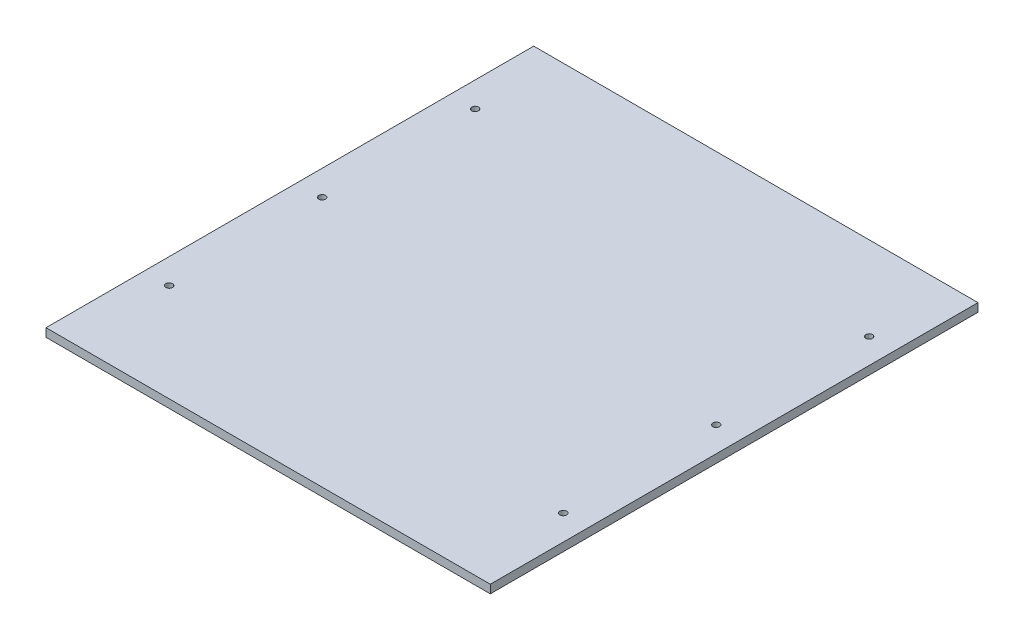
ISO-10303-21;
HEADER;
FILE_DESCRIPTION(('STEP AP214'),'2;1');
FILE_NAME('part.step','',(''),(''),'','','');
FILE_SCHEMA(('AUTOMOTIVE_DESIGN { 1 0 10303 214 1 1 1 1 }'));
ENDSEC;
DATA;
#1=APPLICATION_CONTEXT('core data for automotive mechanical design processes');
#2=APPLICATION_PROTOCOL_DEFINITION('international standard','automotive_design',2000,#1);
#3=PRODUCT_CONTEXT('',#1,'mechanical');
#4=PRODUCT('Part','Part','',(#3));
#5=PRODUCT_RELATED_PRODUCT_CATEGORY('part','',(#4));
#6=PRODUCT_DEFINITION_FORMATION('','',#4);
#7=PRODUCT_DEFINITION_CONTEXT('part definition',#1,'design');
#8=PRODUCT_DEFINITION('design','',#6,#7);
#9=PRODUCT_DEFINITION_SHAPE('','',#8);
#10=(LENGTH_UNIT() NAMED_UNIT(*) SI_UNIT(.MILLI.,.METRE.));
#11=(NAMED_UNIT(*) PLANE_ANGLE_UNIT() SI_UNIT($,.RADIAN.));
#12=(NAMED_UNIT(*) SI_UNIT($,.STERADIAN.) SOLID_ANGLE_UNIT());
#13=UNCERTAINTY_MEASURE_WITH_UNIT(LENGTH_MEASURE(1.E-05),#10,'distance_accuracy_value','');
#14=(GEOMETRIC_REPRESENTATION_CONTEXT(3) GLOBAL_UNCERTAINTY_ASSIGNED_CONTEXT((#13)) GLOBAL_UNIT_ASSIGNED_CONTEXT((#10,
#11,#12)) REPRESENTATION_CONTEXT('',''));
#15=CARTESIAN_POINT('',(0.,0.,0.));
#16=DIRECTION('',(0.,0.,1.));
#17=DIRECTION('',(1.,0.,0.));
#18=AXIS2_PLACEMENT_3D('',#15,#16,#17);
#19=CARTESIAN_POINT('',(-139.604705882353,5.,-141.317647058824));
#20=DIRECTION('',(1.,0.,0.));
#21=DIRECTION('',(0.,0.,-1.));
#22=AXIS2_PLACEMENT_3D('',#19,#20,#21);
#23=PLANE('',#22);
#24=DIRECTION('',(0.,0.,1.));
#25=VECTOR('',#24,1.);
#26=CARTESIAN_POINT('',(-139.604705882353,0.,-141.317647058824));
#27=LINE('',#26,#25);
#28=CARTESIAN_POINT('',(-139.604705882353,0.,-141.317647058824));
#29=VERTEX_POINT('',#28);
#30=CARTESIAN_POINT('',(-139.604705882353,0.,149.882352941176));
#31=VERTEX_POINT('',#30);
#32=EDGE_CURVE('E113',#29,#31,#27,.T.);
#33=ORIENTED_EDGE('',*,*,#32,.T.);
#34=DIRECTION('',(0.,-1.,0.));
#35=VECTOR('',#34,1.);
#36=CARTESIAN_POINT('',(-139.604705882353,5.,149.882352941176));
#37=LINE('',#36,#35);
#38=CARTESIAN_POINT('',(-139.604705882353,5.,149.882352941176));
#39=VERTEX_POINT('',#38);
#40=EDGE_CURVE('E11',#39,#31,#37,.T.);
#41=ORIENTED_EDGE('',*,*,#40,.F.);
#42=DIRECTION('',(0.,0.,1.));
#43=VECTOR('',#42,1.);
#44=CARTESIAN_POINT('',(-139.604705882353,5.,-141.317647058824));
#45=LINE('',#44,#43);
#46=CARTESIAN_POINT('',(-139.604705882353,5.,-141.317647058824));
#47=VERTEX_POINT('',#46);
#48=EDGE_CURVE('E97',#47,#39,#45,.T.);
#49=ORIENTED_EDGE('',*,*,#48,.F.);
#50=DIRECTION('',(0.,-1.,0.));
#51=VECTOR('',#50,1.);
#52=CARTESIAN_POINT('',(-139.604705882353,5.,-141.317647058824));
#53=LINE('',#52,#51);
#54=EDGE_CURVE('E109',#47,#29,#53,.T.);
#55=ORIENTED_EDGE('',*,*,#54,.T.);
#56=EDGE_LOOP('',(#33,#41,#49,#55));
#57=FACE_BOUND('',#56,.T.);
#58=ADVANCED_FACE('F45',(#57),#23,.F.);
#59=CARTESIAN_POINT('',(-139.604705882353,5.,149.882352941176));
#60=DIRECTION('',(0.,0.,-1.));
#61=DIRECTION('',(-1.,0.,0.));
#62=AXIS2_PLACEMENT_3D('',#59,#60,#61);
#63=PLANE('',#62);
#64=DIRECTION('',(1.,0.,0.));
#65=VECTOR('',#64,1.);
#66=CARTESIAN_POINT('',(-139.604705882353,0.,149.882352941176));
#67=LINE('',#66,#65);
#68=CARTESIAN_POINT('',(125.675294117647,0.,149.882352941176));
#69=VERTEX_POINT('',#68);
#70=EDGE_CURVE('E102',#31,#69,#67,.T.);
#71=ORIENTED_EDGE('',*,*,#70,.T.);
#72=DIRECTION('',(0.,-1.,0.));
#73=VECTOR('',#72,1.);
#74=CARTESIAN_POINT('',(125.675294117647,5.,149.882352941176));
#75=LINE('',#74,#73);
#76=CARTESIAN_POINT('',(125.675294117647,5.,149.882352941176));
#77=VERTEX_POINT('',#76);
#78=EDGE_CURVE('E54',#77,#69,#75,.T.);
#79=ORIENTED_EDGE('',*,*,#78,.F.);
#80=DIRECTION('',(1.,0.,0.));
#81=VECTOR('',#80,1.);
#82=CARTESIAN_POINT('',(-139.604705882353,5.,149.882352941176));
#83=LINE('',#82,#81);
#84=EDGE_CURVE('E92',#39,#77,#83,.T.);
#85=ORIENTED_EDGE('',*,*,#84,.F.);
#86=ORIENTED_EDGE('',*,*,#40,.T.);
#87=EDGE_LOOP('',(#71,#79,#85,#86));
#88=FACE_BOUND('',#87,.T.);
#89=ADVANCED_FACE('F101',(#88),#63,.F.);
#90=CARTESIAN_POINT('',(125.675294117647,5.,-141.317647058824));
#91=DIRECTION('',(-1.,0.,0.));
#92=DIRECTION('',(0.,0.,1.));
#93=AXIS2_PLACEMENT_3D('',#90,#91,#92);
#94=PLANE('',#93);
#95=DIRECTION('',(0.,0.,-1.));
#96=VECTOR('',#95,1.);
#97=CARTESIAN_POINT('',(125.675294117647,0.,-141.317647058824));
#98=LINE('',#97,#96);
#99=CARTESIAN_POINT('',(125.675294117647,0.,-141.317647058824));
#100=VERTEX_POINT('',#99);
#101=EDGE_CURVE('E79',#69,#100,#98,.T.);
#102=ORIENTED_EDGE('',*,*,#101,.T.);
#103=DIRECTION('',(0.,-1.,0.));
#104=VECTOR('',#103,1.);
#105=CARTESIAN_POINT('',(125.675294117647,5.,-141.317647058824));
#106=LINE('',#105,#104);
#107=CARTESIAN_POINT('',(125.675294117647,5.,-141.317647058824));
#108=VERTEX_POINT('',#107);
#109=EDGE_CURVE('E104',#108,#100,#106,.T.);
#110=ORIENTED_EDGE('',*,*,#109,.F.);
#111=DIRECTION('',(0.,0.,-1.));
#112=VECTOR('',#111,1.);
#113=CARTESIAN_POINT('',(125.675294117647,5.,-141.317647058824));
#114=LINE('',#113,#112);
#115=EDGE_CURVE('E95',#77,#108,#114,.T.);
#116=ORIENTED_EDGE('',*,*,#115,.F.);
#117=ORIENTED_EDGE('',*,*,#78,.T.);
#118=EDGE_LOOP('',(#102,#110,#116,#117));
#119=FACE_BOUND('',#118,.T.);
#120=ADVANCED_FACE('F105',(#119),#94,.F.);
#121=CARTESIAN_POINT('',(-139.604705882353,5.,-141.317647058824));
#122=DIRECTION('',(0.,0.,1.));
#123=DIRECTION('',(1.,0.,0.));
#124=AXIS2_PLACEMENT_3D('',#121,#122,#123);
#125=PLANE('',#124);
#126=DIRECTION('',(-1.,0.,0.));
#127=VECTOR('',#126,1.);
#128=CARTESIAN_POINT('',(-139.604705882353,0.,-141.317647058824));
#129=LINE('',#128,#127);
#130=EDGE_CURVE('E85',#100,#29,#129,.T.);
#131=ORIENTED_EDGE('',*,*,#130,.T.);
#132=ORIENTED_EDGE('',*,*,#54,.F.);
#133=DIRECTION('',(-1.,0.,0.));
#134=VECTOR('',#133,1.);
#135=CARTESIAN_POINT('',(-139.604705882353,5.,-141.317647058824));
#136=LINE('',#135,#134);
#137=EDGE_CURVE('E62',#108,#47,#136,.T.);
#138=ORIENTED_EDGE('',*,*,#137,.F.);
#139=ORIENTED_EDGE('',*,*,#109,.T.);
#140=EDGE_LOOP('',(#131,#132,#138,#139));
#141=FACE_BOUND('',#140,.T.);
#142=ADVANCED_FACE('F127',(#141),#125,.F.);
#143=CARTESIAN_POINT('',(0.,5.,0.));
#144=DIRECTION('',(0.,1.,0.));
#145=DIRECTION('',(0.,0.,1.));
#146=AXIS2_PLACEMENT_3D('',#143,#144,#145);
#147=PLANE('',#146);
#148=CARTESIAN_POINT('',(-124.604705882353,5.,0.));
#149=DIRECTION('',(0.,1.,0.));
#150=DIRECTION('',(0.,0.,1.));
#151=AXIS2_PLACEMENT_3D('',#148,#149,#150);
#152=CIRCLE('',#151,2.);
#153=CARTESIAN_POINT('',(-124.604705882353,5.,2.));
#154=VERTEX_POINT('',#153);
#155=EDGE_CURVE('E138',#154,#154,#152,.T.);
#156=ORIENTED_EDGE('',*,*,#155,.F.);
#157=EDGE_LOOP('',(#156));
#158=FACE_BOUND('',#157,.T.);
#159=CARTESIAN_POINT('',(-124.604705882353,5.,91.3176470588235));
#160=DIRECTION('',(0.,1.,0.));
#161=DIRECTION('',(0.,0.,-1.));
#162=AXIS2_PLACEMENT_3D('',#159,#160,#161);
#163=CIRCLE('',#162,2.);
#164=CARTESIAN_POINT('',(-124.604705882353,5.,89.3176470588235));
#165=VERTEX_POINT('',#164);
#166=EDGE_CURVE('E163',#165,#165,#163,.T.);
#167=ORIENTED_EDGE('',*,*,#166,.F.);
#168=EDGE_LOOP('',(#167));
#169=FACE_BOUND('',#168,.T.);
#170=CARTESIAN_POINT('',(110.675294117647,5.,-91.3176470588235));
#171=DIRECTION('',(0.,1.,0.));
#172=DIRECTION('',(0.,0.,1.));
#173=AXIS2_PLACEMENT_3D('',#170,#171,#172);
#174=CIRCLE('',#173,2.);
#175=CARTESIAN_POINT('',(110.675294117647,5.,-89.3176470588235));
#176=VERTEX_POINT('',#175);
#177=EDGE_CURVE('E155',#176,#176,#174,.T.);
#178=ORIENTED_EDGE('',*,*,#177,.F.);
#179=EDGE_LOOP('',(#178));
#180=FACE_BOUND('',#179,.T.);
#181=CARTESIAN_POINT('',(110.675294117647,5.,0.));
#182=DIRECTION('',(0.,1.,0.));
#183=DIRECTION('',(0.,0.,1.));
#184=AXIS2_PLACEMENT_3D('',#181,#182,#183);
#185=CIRCLE('',#184,2.);
#186=CARTESIAN_POINT('',(110.675294117647,5.,2.));
#187=VERTEX_POINT('',#186);
#188=EDGE_CURVE('E146',#187,#187,#185,.T.);
#189=ORIENTED_EDGE('',*,*,#188,.F.);
#190=EDGE_LOOP('',(#189));
#191=FACE_BOUND('',#190,.T.);
#192=CARTESIAN_POINT('',(110.675294117647,5.,91.3176470588235));
#193=DIRECTION('',(0.,1.,0.));
#194=DIRECTION('',(0.,0.,1.));
#195=AXIS2_PLACEMENT_3D('',#192,#193,#194);
#196=CIRCLE('',#195,2.);
#197=CARTESIAN_POINT('',(110.675294117647,5.,93.3176470588235));
#198=VERTEX_POINT('',#197);
#199=EDGE_CURVE('E147',#198,#198,#196,.T.);
#200=ORIENTED_EDGE('',*,*,#199,.F.);
#201=EDGE_LOOP('',(#200));
#202=FACE_BOUND('',#201,.T.);
#203=CARTESIAN_POINT('',(-124.604705882353,5.,-91.3176470588235));
#204=DIRECTION('',(0.,1.,0.));
#205=DIRECTION('',(0.,0.,1.));
#206=AXIS2_PLACEMENT_3D('',#203,#204,#205);
#207=CIRCLE('',#206,2.);
#208=CARTESIAN_POINT('',(-124.604705882353,5.,-89.3176470588235));
#209=VERTEX_POINT('',#208);
#210=EDGE_CURVE('E134',#209,#209,#207,.T.);
#211=ORIENTED_EDGE('',*,*,#210,.F.);
#212=EDGE_LOOP('',(#211));
#213=FACE_BOUND('',#212,.T.);
#214=ORIENTED_EDGE('',*,*,#48,.T.);
#215=ORIENTED_EDGE('',*,*,#84,.T.);
#216=ORIENTED_EDGE('',*,*,#115,.T.);
#217=ORIENTED_EDGE('',*,*,#137,.T.);
#218=EDGE_LOOP('',(#214,#215,#216,#217));
#219=FACE_BOUND('',#218,.T.);
#220=ADVANCED_FACE('F93',(#158,#169,#180,#191,#202,#213,#219),#147,.T.);
#221=CARTESIAN_POINT('',(0.,0.,0.));
#222=DIRECTION('',(0.,1.,0.));
#223=DIRECTION('',(0.,0.,1.));
#224=AXIS2_PLACEMENT_3D('',#221,#222,#223);
#225=PLANE('',#224);
#226=CARTESIAN_POINT('',(-124.604705882353,0.,0.));
#227=DIRECTION('',(0.,1.,0.));
#228=DIRECTION('',(0.,0.,1.));
#229=AXIS2_PLACEMENT_3D('',#226,#227,#228);
#230=CIRCLE('',#229,2.);
#231=CARTESIAN_POINT('',(-124.604705882353,0.,2.));
#232=VERTEX_POINT('',#231);
#233=EDGE_CURVE('E167',#232,#232,#230,.T.);
#234=ORIENTED_EDGE('',*,*,#233,.T.);
#235=EDGE_LOOP('',(#234));
#236=FACE_BOUND('',#235,.T.);
#237=CARTESIAN_POINT('',(-124.604705882353,0.,91.3176470588235));
#238=DIRECTION('',(0.,1.,0.));
#239=DIRECTION('',(0.,0.,-1.));
#240=AXIS2_PLACEMENT_3D('',#237,#238,#239);
#241=CIRCLE('',#240,2.);
#242=CARTESIAN_POINT('',(-124.604705882353,0.,89.3176470588235));
#243=VERTEX_POINT('',#242);
#244=EDGE_CURVE('E159',#243,#243,#241,.T.);
#245=ORIENTED_EDGE('',*,*,#244,.T.);
#246=EDGE_LOOP('',(#245));
#247=FACE_BOUND('',#246,.T.);
#248=CARTESIAN_POINT('',(110.675294117647,0.,-91.3176470588235));
#249=DIRECTION('',(0.,1.,0.));
#250=DIRECTION('',(0.,0.,1.));
#251=AXIS2_PLACEMENT_3D('',#248,#249,#250);
#252=CIRCLE('',#251,2.);
#253=CARTESIAN_POINT('',(110.675294117647,0.,-89.3176470588235));
#254=VERTEX_POINT('',#253);
#255=EDGE_CURVE('E151',#254,#254,#252,.T.);
#256=ORIENTED_EDGE('',*,*,#255,.T.);
#257=EDGE_LOOP('',(#256));
#258=FACE_BOUND('',#257,.T.);
#259=CARTESIAN_POINT('',(110.675294117647,0.,0.));
#260=DIRECTION('',(0.,1.,0.));
#261=DIRECTION('',(0.,0.,1.));
#262=AXIS2_PLACEMENT_3D('',#259,#260,#261);
#263=CIRCLE('',#262,2.);
#264=CARTESIAN_POINT('',(110.675294117647,0.,2.));
#265=VERTEX_POINT('',#264);
#266=EDGE_CURVE('E142',#265,#265,#263,.T.);
#267=ORIENTED_EDGE('',*,*,#266,.T.);
#268=EDGE_LOOP('',(#267));
#269=FACE_BOUND('',#268,.T.);
#270=CARTESIAN_POINT('',(110.675294117647,0.,91.3176470588235));
#271=DIRECTION('',(0.,1.,0.));
#272=DIRECTION('',(0.,0.,1.));
#273=AXIS2_PLACEMENT_3D('',#270,#271,#272);
#274=CIRCLE('',#273,2.);
#275=CARTESIAN_POINT('',(110.675294117647,0.,93.3176470588235));
#276=VERTEX_POINT('',#275);
#277=EDGE_CURVE('E174',#276,#276,#274,.T.);
#278=ORIENTED_EDGE('',*,*,#277,.T.);
#279=EDGE_LOOP('',(#278));
#280=FACE_BOUND('',#279,.T.);
#281=CARTESIAN_POINT('',(-124.604705882353,0.,-91.3176470588235));
#282=DIRECTION('',(0.,1.,0.));
#283=DIRECTION('',(0.,0.,1.));
#284=AXIS2_PLACEMENT_3D('',#281,#282,#283);
#285=CIRCLE('',#284,2.);
#286=CARTESIAN_POINT('',(-124.604705882353,0.,-89.3176470588235));
#287=VERTEX_POINT('',#286);
#288=EDGE_CURVE('E117',#287,#287,#285,.T.);
#289=ORIENTED_EDGE('',*,*,#288,.T.);
#290=EDGE_LOOP('',(#289));
#291=FACE_BOUND('',#290,.T.);
#292=ORIENTED_EDGE('',*,*,#32,.F.);
#293=ORIENTED_EDGE('',*,*,#130,.F.);
#294=ORIENTED_EDGE('',*,*,#101,.F.);
#295=ORIENTED_EDGE('',*,*,#70,.F.);
#296=EDGE_LOOP('',(#292,#293,#294,#295));
#297=FACE_BOUND('',#296,.T.);
#298=ADVANCED_FACE('F130',(#236,#247,#258,#269,#280,#291,#297),#225,.F.);
#299=CARTESIAN_POINT('',(-124.604705882353,0.,-91.3176470588235));
#300=DIRECTION('',(0.,1.,0.));
#301=DIRECTION('',(0.,0.,1.));
#302=AXIS2_PLACEMENT_3D('',#299,#300,#301);
#303=CYLINDRICAL_SURFACE('',#302,2.);
#304=ORIENTED_EDGE('',*,*,#288,.F.);
#305=EDGE_LOOP('',(#304));
#306=FACE_BOUND('',#305,.T.);
#307=ORIENTED_EDGE('',*,*,#210,.T.);
#308=EDGE_LOOP('',(#307));
#309=FACE_BOUND('',#308,.T.);
#310=ADVANCED_FACE('F190',(#306,#309),#303,.F.);
#311=CARTESIAN_POINT('',(110.675294117647,0.,91.3176470588235));
#312=DIRECTION('',(0.,1.,0.));
#313=DIRECTION('',(0.,0.,1.));
#314=AXIS2_PLACEMENT_3D('',#311,#312,#313);
#315=CYLINDRICAL_SURFACE('',#314,2.);
#316=ORIENTED_EDGE('',*,*,#277,.F.);
#317=EDGE_LOOP('',(#316));
#318=FACE_BOUND('',#317,.T.);
#319=ORIENTED_EDGE('',*,*,#199,.T.);
#320=EDGE_LOOP('',(#319));
#321=FACE_BOUND('',#320,.T.);
#322=ADVANCED_FACE('F182',(#318,#321),#315,.F.);
#323=CARTESIAN_POINT('',(110.675294117647,0.,0.));
#324=DIRECTION('',(0.,1.,0.));
#325=DIRECTION('',(0.,0.,1.));
#326=AXIS2_PLACEMENT_3D('',#323,#324,#325);
#327=CYLINDRICAL_SURFACE('',#326,2.);
#328=ORIENTED_EDGE('',*,*,#266,.F.);
#329=EDGE_LOOP('',(#328));
#330=FACE_BOUND('',#329,.T.);
#331=ORIENTED_EDGE('',*,*,#188,.T.);
#332=EDGE_LOOP('',(#331));
#333=FACE_BOUND('',#332,.T.);
#334=ADVANCED_FACE('F198',(#330,#333),#327,.F.);
#335=CARTESIAN_POINT('',(110.675294117647,0.,-91.3176470588235));
#336=DIRECTION('',(0.,1.,0.));
#337=DIRECTION('',(0.,0.,1.));
#338=AXIS2_PLACEMENT_3D('',#335,#336,#337);
#339=CYLINDRICAL_SURFACE('',#338,2.);
#340=ORIENTED_EDGE('',*,*,#255,.F.);
#341=EDGE_LOOP('',(#340));
#342=FACE_BOUND('',#341,.T.);
#343=ORIENTED_EDGE('',*,*,#177,.T.);
#344=EDGE_LOOP('',(#343));
#345=FACE_BOUND('',#344,.T.);
#346=ADVANCED_FACE('F249',(#342,#345),#339,.F.);
#347=CARTESIAN_POINT('',(-124.604705882353,0.,91.3176470588235));
#348=DIRECTION('',(0.,1.,0.));
#349=DIRECTION('',(0.,0.,1.));
#350=AXIS2_PLACEMENT_3D('',#347,#348,#349);
#351=CYLINDRICAL_SURFACE('',#350,2.);
#352=ORIENTED_EDGE('',*,*,#244,.F.);
#353=EDGE_LOOP('',(#352));
#354=FACE_BOUND('',#353,.T.);
#355=ORIENTED_EDGE('',*,*,#166,.T.);
#356=EDGE_LOOP('',(#355));
#357=FACE_BOUND('',#356,.T.);
#358=ADVANCED_FACE('F258',(#354,#357),#351,.F.);
#359=CARTESIAN_POINT('',(-124.604705882353,0.,0.));
#360=DIRECTION('',(0.,1.,0.));
#361=DIRECTION('',(0.,0.,1.));
#362=AXIS2_PLACEMENT_3D('',#359,#360,#361);
#363=CYLINDRICAL_SURFACE('',#362,2.);
#364=ORIENTED_EDGE('',*,*,#233,.F.);
#365=EDGE_LOOP('',(#364));
#366=FACE_BOUND('',#365,.T.);
#367=ORIENTED_EDGE('',*,*,#155,.T.);
#368=EDGE_LOOP('',(#367));
#369=FACE_BOUND('',#368,.T.);
#370=ADVANCED_FACE('F268',(#366,#369),#363,.F.);
#371=CLOSED_SHELL('',(#58,#89,#120,#142,#220,#298,#310,#322,#334,#346,#358,#370));
#372=MANIFOLD_SOLID_BREP('B2',#371);
#373=ADVANCED_BREP_SHAPE_REPRESENTATION('',(#18,#372),#14);
#374=SHAPE_DEFINITION_REPRESENTATION(#9,#373);
ENDSEC;
END-ISO-10303-21;
